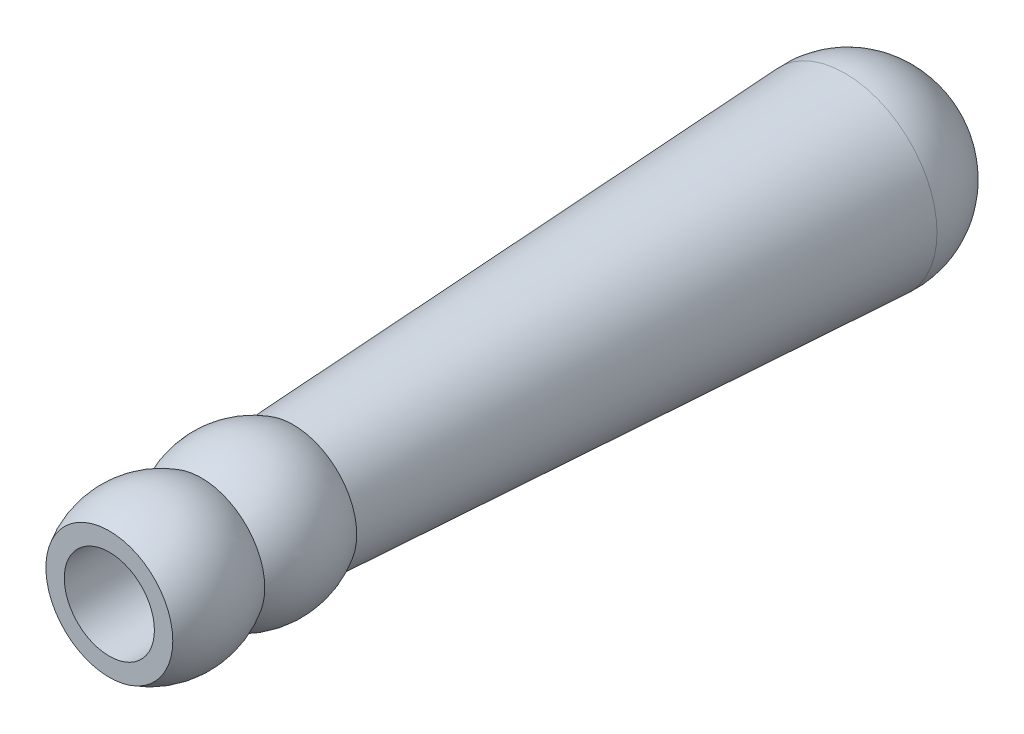
ISO-10303-21;
HEADER;
FILE_DESCRIPTION(('STEP AP214'),'2;1');
FILE_NAME('part.step','',(''),(''),'','','');
FILE_SCHEMA(('AUTOMOTIVE_DESIGN { 1 0 10303 214 1 1 1 1 }'));
ENDSEC;
DATA;
#1=APPLICATION_CONTEXT('core data for automotive mechanical design processes');
#2=APPLICATION_PROTOCOL_DEFINITION('international standard','automotive_design',2000,#1);
#3=PRODUCT_CONTEXT('',#1,'mechanical');
#4=PRODUCT('Part','Part','',(#3));
#5=PRODUCT_RELATED_PRODUCT_CATEGORY('part','',(#4));
#6=PRODUCT_DEFINITION_FORMATION('','',#4);
#7=PRODUCT_DEFINITION_CONTEXT('part definition',#1,'design');
#8=PRODUCT_DEFINITION('design','',#6,#7);
#9=PRODUCT_DEFINITION_SHAPE('','',#8);
#10=(LENGTH_UNIT() NAMED_UNIT(*) SI_UNIT(.MILLI.,.METRE.));
#11=(NAMED_UNIT(*) PLANE_ANGLE_UNIT() SI_UNIT($,.RADIAN.));
#12=(NAMED_UNIT(*) SI_UNIT($,.STERADIAN.) SOLID_ANGLE_UNIT());
#13=UNCERTAINTY_MEASURE_WITH_UNIT(LENGTH_MEASURE(1.E-05),#10,'distance_accuracy_value','');
#14=(GEOMETRIC_REPRESENTATION_CONTEXT(3) GLOBAL_UNCERTAINTY_ASSIGNED_CONTEXT((#13)) GLOBAL_UNIT_ASSIGNED_CONTEXT((#10,
#11,#12)) REPRESENTATION_CONTEXT('',''));
#15=CARTESIAN_POINT('',(0.,0.,0.));
#16=DIRECTION('',(0.,0.,1.));
#17=DIRECTION('',(1.,0.,0.));
#18=AXIS2_PLACEMENT_3D('',#15,#16,#17);
#19=CARTESIAN_POINT('',(0.,0.,-25.4));
#20=DIRECTION('',(0.,0.,-1.));
#21=DIRECTION('',(-1.,0.,0.));
#22=AXIS2_PLACEMENT_3D('',#19,#20,#21);
#23=CONICAL_SURFACE('',#22,8.76300000000009,0.0516207663957739);
#24=CARTESIAN_POINT('',(-3.54734504026462E-13,0.,-101.6));
#25=DIRECTION('',(0.,0.,1.));
#26=DIRECTION('',(1.,0.,0.));
#27=AXIS2_PLACEMENT_3D('',#24,#25,#26);
#28=CIRCLE('',#27,12.7000000000004);
#29=CARTESIAN_POINT('',(12.7,0.,-101.6));
#30=VERTEX_POINT('',#29);
#31=EDGE_CURVE('E11',#30,#30,#28,.T.);
#32=ORIENTED_EDGE('',*,*,#31,.T.);
#33=EDGE_LOOP('',(#32));
#34=FACE_BOUND('',#33,.T.);
#35=CARTESIAN_POINT('',(0.,0.,-25.4));
#36=DIRECTION('',(0.,0.,1.));
#37=DIRECTION('',(1.,0.,0.));
#38=AXIS2_PLACEMENT_3D('',#35,#36,#37);
#39=CIRCLE('',#38,8.76300000000009);
#40=CARTESIAN_POINT('',(8.76300000000001,0.,-25.4));
#41=VERTEX_POINT('',#40);
#42=EDGE_CURVE('E55',#41,#41,#39,.T.);
#43=ORIENTED_EDGE('',*,*,#42,.F.);
#44=EDGE_LOOP('',(#43));
#45=FACE_BOUND('',#44,.T.);
#46=ADVANCED_FACE('F36',(#34,#45),#23,.T.);
#47=CARTESIAN_POINT('',(0.675084789397576,0.,-102.275084789398));
#48=DIRECTION('',(0.,-1.,0.));
#49=DIRECTION('',(1.,0.,0.));
#50=AXIS2_PLACEMENT_3D('',#47,#48,#49);
#51=CIRCLE('',#50,12.043850102648);
#52=TRIMMED_CURVE('',#51,(PARAMETER_VALUE(-1.62687796076712)),
(PARAMETER_VALUE(1.62687796076712)),.T.,.PARAMETER.);
#53=CARTESIAN_POINT('',(-3.57027775399477E-13,0.,-102.275084789398));
#54=DIRECTION('',(0.,0.,1.));
#55=AXIS1_PLACEMENT('',#53,#54);
#56=SURFACE_OF_REVOLUTION('',#52,#55);
#57=CARTESIAN_POINT('',(0.,0.,-114.3));
#58=VERTEX_POINT('',#57);
#59=VERTEX_LOOP('',#58);
#60=FACE_BOUND('',#59,.T.);
#61=ORIENTED_EDGE('',*,*,#31,.F.);
#62=EDGE_LOOP('',(#61));
#63=FACE_BOUND('',#62,.T.);
#64=ADVANCED_FACE('F45',(#60,#63),#56,.T.);
#65=CARTESIAN_POINT('',(-1.08544126068242E-11,0.,-19.0499999999982));
#66=DIRECTION('',(0.,0.,-1.));
#67=DIRECTION('',(-1.,0.,0.));
#68=AXIS2_PLACEMENT_3D('',#65,#66,#67);
#69=PLANE('',#68);
#70=CARTESIAN_POINT('',(0.,0.,-19.05));
#71=DIRECTION('',(0.,0.,1.));
#72=DIRECTION('',(1.,0.,0.));
#73=AXIS2_PLACEMENT_3D('',#70,#71,#72);
#74=CIRCLE('',#73,6.22300000000007);
#75=CARTESIAN_POINT('',(6.223,0.,-19.05));
#76=VERTEX_POINT('',#75);
#77=EDGE_CURVE('E42',#76,#76,#74,.T.);
#78=ORIENTED_EDGE('',*,*,#77,.T.);
#79=EDGE_LOOP('',(#78));
#80=FACE_BOUND('',#79,.T.);
#81=ADVANCED_FACE('F48',(#80),#69,.F.);
#82=CARTESIAN_POINT('',(2.83040797641004E-12,0.,810.661063807336));
#83=DIRECTION('',(0.,0.,1.));
#84=DIRECTION('',(1.,0.,0.));
#85=AXIS2_PLACEMENT_3D('',#82,#83,#84);
#86=CYLINDRICAL_SURFACE('',#85,6.22300000000003);
#87=ORIENTED_EDGE('',*,*,#77,.F.);
#88=EDGE_LOOP('',(#87));
#89=FACE_BOUND('',#88,.T.);
#90=CARTESIAN_POINT('',(0.,0.,0.));
#91=DIRECTION('',(0.,0.,1.));
#92=DIRECTION('',(1.,0.,0.));
#93=AXIS2_PLACEMENT_3D('',#90,#91,#92);
#94=CIRCLE('',#93,6.223);
#95=CARTESIAN_POINT('',(6.223,0.,0.));
#96=VERTEX_POINT('',#95);
#97=EDGE_CURVE('E66',#96,#96,#94,.T.);
#98=ORIENTED_EDGE('',*,*,#97,.T.);
#99=EDGE_LOOP('',(#98));
#100=FACE_BOUND('',#99,.T.);
#101=ADVANCED_FACE('F72',(#89,#100),#86,.F.);
#102=CARTESIAN_POINT('',(0.,0.,0.));
#103=DIRECTION('',(0.,0.,1.));
#104=DIRECTION('',(1.,0.,0.));
#105=AXIS2_PLACEMENT_3D('',#102,#103,#104);
#106=PLANE('',#105);
#107=CARTESIAN_POINT('',(0.,0.,0.));
#108=DIRECTION('',(0.,0.,1.));
#109=DIRECTION('',(1.,0.,0.));
#110=AXIS2_PLACEMENT_3D('',#107,#108,#109);
#111=CIRCLE('',#110,8.763);
#112=CARTESIAN_POINT('',(8.763,0.,0.));
#113=VERTEX_POINT('',#112);
#114=EDGE_CURVE('E60',#113,#113,#111,.T.);
#115=ORIENTED_EDGE('',*,*,#114,.T.);
#116=EDGE_LOOP('',(#115));
#117=FACE_BOUND('',#116,.T.);
#118=ORIENTED_EDGE('',*,*,#97,.F.);
#119=EDGE_LOOP('',(#118));
#120=FACE_BOUND('',#119,.T.);
#121=ADVANCED_FACE('F75',(#117,#120),#106,.T.);
#122=CARTESIAN_POINT('',(0.,0.,-6.35));
#123=DIRECTION('',(0.,0.,1.));
#124=DIRECTION('',(1.,0.,0.));
#125=AXIS2_PLACEMENT_3D('',#122,#123,#124);
#126=DEGENERATE_TOROIDAL_SURFACE('',#125,1.74746323480275,12.2797531493976,.F.);
#127=CARTESIAN_POINT('',(0.,0.,-12.7));
#128=DIRECTION('',(0.,0.,1.));
#129=DIRECTION('',(1.,0.,0.));
#130=AXIS2_PLACEMENT_3D('',#127,#128,#129);
#131=CIRCLE('',#130,8.76300000000004);
#132=CARTESIAN_POINT('',(8.763,0.,-12.7000000000001));
#133=VERTEX_POINT('',#132);
#134=EDGE_CURVE('E57',#133,#133,#131,.T.);
#135=ORIENTED_EDGE('',*,*,#134,.T.);
#136=EDGE_LOOP('',(#135));
#137=FACE_BOUND('',#136,.T.);
#138=ORIENTED_EDGE('',*,*,#114,.F.);
#139=EDGE_LOOP('',(#138));
#140=FACE_BOUND('',#139,.T.);
#141=ADVANCED_FACE('F80',(#137,#140),#126,.F.);
#142=CARTESIAN_POINT('',(0.,0.,-19.05));
#143=DIRECTION('',(0.,0.,1.));
#144=DIRECTION('',(1.,0.,0.));
#145=AXIS2_PLACEMENT_3D('',#142,#143,#144);
#146=DEGENERATE_TOROIDAL_SURFACE('',#145,1.74746323480271,12.2797531493976,.F.);
#147=ORIENTED_EDGE('',*,*,#42,.T.);
#148=EDGE_LOOP('',(#147));
#149=FACE_BOUND('',#148,.T.);
#150=ORIENTED_EDGE('',*,*,#134,.F.);
#151=EDGE_LOOP('',(#150));
#152=FACE_BOUND('',#151,.T.);
#153=ADVANCED_FACE('F86',(#149,#152),#146,.F.);
#154=CLOSED_SHELL('',(#46,#64,#81,#101,#121,#141,#153));
#155=MANIFOLD_SOLID_BREP('B2',#154);
#156=ADVANCED_BREP_SHAPE_REPRESENTATION('',(#18,#155),#14);
#157=SHAPE_DEFINITION_REPRESENTATION(#9,#156);
ENDSEC;
END-ISO-10303-21;
